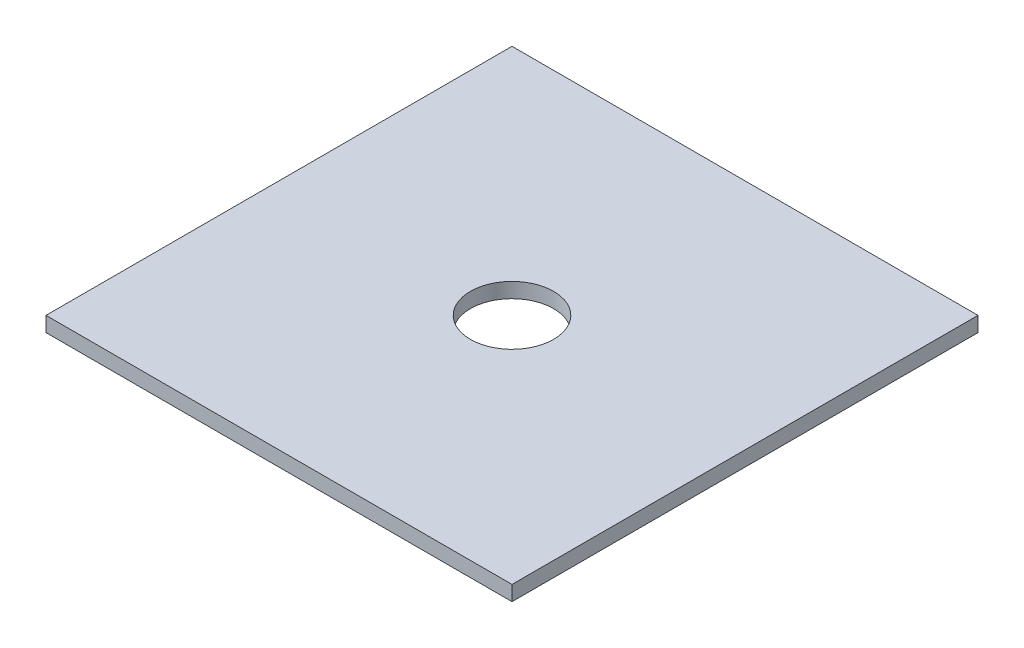
ISO-10303-21;
HEADER;
FILE_DESCRIPTION(('STEP AP214'),'2;1');
FILE_NAME('part.step','',(''),(''),'','','');
FILE_SCHEMA(('AUTOMOTIVE_DESIGN { 1 0 10303 214 1 1 1 1 }'));
ENDSEC;
DATA;
#1=APPLICATION_CONTEXT('core data for automotive mechanical design processes');
#2=APPLICATION_PROTOCOL_DEFINITION('international standard','automotive_design',2000,#1);
#3=PRODUCT_CONTEXT('',#1,'mechanical');
#4=PRODUCT('Part','Part','',(#3));
#5=PRODUCT_RELATED_PRODUCT_CATEGORY('part','',(#4));
#6=PRODUCT_DEFINITION_FORMATION('','',#4);
#7=PRODUCT_DEFINITION_CONTEXT('part definition',#1,'design');
#8=PRODUCT_DEFINITION('design','',#6,#7);
#9=PRODUCT_DEFINITION_SHAPE('','',#8);
#10=(LENGTH_UNIT() NAMED_UNIT(*) SI_UNIT(.MILLI.,.METRE.));
#11=(NAMED_UNIT(*) PLANE_ANGLE_UNIT() SI_UNIT($,.RADIAN.));
#12=(NAMED_UNIT(*) SI_UNIT($,.STERADIAN.) SOLID_ANGLE_UNIT());
#13=UNCERTAINTY_MEASURE_WITH_UNIT(LENGTH_MEASURE(1.E-05),#10,'distance_accuracy_value','');
#14=(GEOMETRIC_REPRESENTATION_CONTEXT(3) GLOBAL_UNCERTAINTY_ASSIGNED_CONTEXT((#13)) GLOBAL_UNIT_ASSIGNED_CONTEXT((#10,
#11,#12)) REPRESENTATION_CONTEXT('',''));
#15=CARTESIAN_POINT('',(0.,0.,0.));
#16=DIRECTION('',(0.,0.,1.));
#17=DIRECTION('',(1.,0.,0.));
#18=AXIS2_PLACEMENT_3D('',#15,#16,#17);
#19=CARTESIAN_POINT('',(280.,18.,280.));
#20=DIRECTION('',(-1.,0.,0.));
#21=DIRECTION('',(0.,0.,1.));
#22=AXIS2_PLACEMENT_3D('',#19,#20,#21);
#23=PLANE('',#22);
#24=DIRECTION('',(0.,0.,-1.));
#25=VECTOR('',#24,1.);
#26=CARTESIAN_POINT('',(280.,0.,280.));
#27=LINE('',#26,#25);
#28=CARTESIAN_POINT('',(280.,0.,280.));
#29=VERTEX_POINT('',#28);
#30=CARTESIAN_POINT('',(280.,0.,-280.));
#31=VERTEX_POINT('',#30);
#32=EDGE_CURVE('E108',#29,#31,#27,.T.);
#33=ORIENTED_EDGE('',*,*,#32,.T.);
#34=DIRECTION('',(0.,-1.,0.));
#35=VECTOR('',#34,1.);
#36=CARTESIAN_POINT('',(280.,18.,-280.));
#37=LINE('',#36,#35);
#38=CARTESIAN_POINT('',(280.,18.,-280.));
#39=VERTEX_POINT('',#38);
#40=EDGE_CURVE('E11',#39,#31,#37,.T.);
#41=ORIENTED_EDGE('',*,*,#40,.F.);
#42=DIRECTION('',(0.,0.,-1.));
#43=VECTOR('',#42,1.);
#44=CARTESIAN_POINT('',(280.,18.,280.));
#45=LINE('',#44,#43);
#46=CARTESIAN_POINT('',(280.,18.,280.));
#47=VERTEX_POINT('',#46);
#48=EDGE_CURVE('E92',#47,#39,#45,.T.);
#49=ORIENTED_EDGE('',*,*,#48,.F.);
#50=DIRECTION('',(0.,-1.,0.));
#51=VECTOR('',#50,1.);
#52=CARTESIAN_POINT('',(280.,18.,280.));
#53=LINE('',#52,#51);
#54=EDGE_CURVE('E104',#47,#29,#53,.T.);
#55=ORIENTED_EDGE('',*,*,#54,.T.);
#56=EDGE_LOOP('',(#33,#41,#49,#55));
#57=FACE_BOUND('',#56,.T.);
#58=ADVANCED_FACE('F40',(#57),#23,.F.);
#59=CARTESIAN_POINT('',(-280.,18.,-280.));
#60=DIRECTION('',(0.,0.,1.));
#61=DIRECTION('',(1.,0.,0.));
#62=AXIS2_PLACEMENT_3D('',#59,#60,#61);
#63=PLANE('',#62);
#64=DIRECTION('',(-1.,0.,0.));
#65=VECTOR('',#64,1.);
#66=CARTESIAN_POINT('',(-280.,0.,-280.));
#67=LINE('',#66,#65);
#68=CARTESIAN_POINT('',(-280.,0.,-280.));
#69=VERTEX_POINT('',#68);
#70=EDGE_CURVE('E97',#31,#69,#67,.T.);
#71=ORIENTED_EDGE('',*,*,#70,.T.);
#72=DIRECTION('',(0.,-1.,0.));
#73=VECTOR('',#72,1.);
#74=CARTESIAN_POINT('',(-280.,18.,-280.));
#75=LINE('',#74,#73);
#76=CARTESIAN_POINT('',(-280.,18.,-280.));
#77=VERTEX_POINT('',#76);
#78=EDGE_CURVE('E49',#77,#69,#75,.T.);
#79=ORIENTED_EDGE('',*,*,#78,.F.);
#80=DIRECTION('',(-1.,0.,0.));
#81=VECTOR('',#80,1.);
#82=CARTESIAN_POINT('',(-280.,18.,-280.));
#83=LINE('',#82,#81);
#84=EDGE_CURVE('E87',#39,#77,#83,.T.);
#85=ORIENTED_EDGE('',*,*,#84,.F.);
#86=ORIENTED_EDGE('',*,*,#40,.T.);
#87=EDGE_LOOP('',(#71,#79,#85,#86));
#88=FACE_BOUND('',#87,.T.);
#89=ADVANCED_FACE('F96',(#88),#63,.F.);
#90=CARTESIAN_POINT('',(-280.,18.,280.));
#91=DIRECTION('',(1.,0.,0.));
#92=DIRECTION('',(0.,0.,-1.));
#93=AXIS2_PLACEMENT_3D('',#90,#91,#92);
#94=PLANE('',#93);
#95=DIRECTION('',(0.,0.,1.));
#96=VECTOR('',#95,1.);
#97=CARTESIAN_POINT('',(-280.,0.,280.));
#98=LINE('',#97,#96);
#99=CARTESIAN_POINT('',(-280.,0.,280.));
#100=VERTEX_POINT('',#99);
#101=EDGE_CURVE('E74',#69,#100,#98,.T.);
#102=ORIENTED_EDGE('',*,*,#101,.T.);
#103=DIRECTION('',(0.,-1.,0.));
#104=VECTOR('',#103,1.);
#105=CARTESIAN_POINT('',(-280.,18.,280.));
#106=LINE('',#105,#104);
#107=CARTESIAN_POINT('',(-280.,18.,280.));
#108=VERTEX_POINT('',#107);
#109=EDGE_CURVE('E99',#108,#100,#106,.T.);
#110=ORIENTED_EDGE('',*,*,#109,.F.);
#111=DIRECTION('',(0.,0.,1.));
#112=VECTOR('',#111,1.);
#113=CARTESIAN_POINT('',(-280.,18.,280.));
#114=LINE('',#113,#112);
#115=EDGE_CURVE('E90',#77,#108,#114,.T.);
#116=ORIENTED_EDGE('',*,*,#115,.F.);
#117=ORIENTED_EDGE('',*,*,#78,.T.);
#118=EDGE_LOOP('',(#102,#110,#116,#117));
#119=FACE_BOUND('',#118,.T.);
#120=ADVANCED_FACE('F100',(#119),#94,.F.);
#121=CARTESIAN_POINT('',(-280.,18.,280.));
#122=DIRECTION('',(0.,0.,-1.));
#123=DIRECTION('',(-1.,0.,0.));
#124=AXIS2_PLACEMENT_3D('',#121,#122,#123);
#125=PLANE('',#124);
#126=DIRECTION('',(1.,0.,0.));
#127=VECTOR('',#126,1.);
#128=CARTESIAN_POINT('',(-280.,0.,280.));
#129=LINE('',#128,#127);
#130=EDGE_CURVE('E80',#100,#29,#129,.T.);
#131=ORIENTED_EDGE('',*,*,#130,.T.);
#132=ORIENTED_EDGE('',*,*,#54,.F.);
#133=DIRECTION('',(1.,0.,0.));
#134=VECTOR('',#133,1.);
#135=CARTESIAN_POINT('',(-280.,18.,280.));
#136=LINE('',#135,#134);
#137=EDGE_CURVE('E57',#108,#47,#136,.T.);
#138=ORIENTED_EDGE('',*,*,#137,.F.);
#139=ORIENTED_EDGE('',*,*,#109,.T.);
#140=EDGE_LOOP('',(#131,#132,#138,#139));
#141=FACE_BOUND('',#140,.T.);
#142=ADVANCED_FACE('F122',(#141),#125,.F.);
#143=CARTESIAN_POINT('',(0.,18.,0.));
#144=DIRECTION('',(0.,-1.,0.));
#145=DIRECTION('',(0.,0.,-1.));
#146=AXIS2_PLACEMENT_3D('',#143,#144,#145);
#147=PLANE('',#146);
#148=CARTESIAN_POINT('',(0.,18.,0.));
#149=DIRECTION('',(0.,1.,0.));
#150=DIRECTION('',(0.,0.,1.));
#151=AXIS2_PLACEMENT_3D('',#148,#149,#150);
#152=CIRCLE('',#151,50.);
#153=CARTESIAN_POINT('',(0.,18.,50.));
#154=VERTEX_POINT('',#153);
#155=EDGE_CURVE('E129',#154,#154,#152,.T.);
#156=ORIENTED_EDGE('',*,*,#155,.F.);
#157=EDGE_LOOP('',(#156));
#158=FACE_BOUND('',#157,.T.);
#159=ORIENTED_EDGE('',*,*,#48,.T.);
#160=ORIENTED_EDGE('',*,*,#84,.T.);
#161=ORIENTED_EDGE('',*,*,#115,.T.);
#162=ORIENTED_EDGE('',*,*,#137,.T.);
#163=EDGE_LOOP('',(#159,#160,#161,#162));
#164=FACE_BOUND('',#163,.T.);
#165=ADVANCED_FACE('F88',(#158,#164),#147,.F.);
#166=CARTESIAN_POINT('',(0.,0.,0.));
#167=DIRECTION('',(0.,-1.,0.));
#168=DIRECTION('',(0.,0.,-1.));
#169=AXIS2_PLACEMENT_3D('',#166,#167,#168);
#170=PLANE('',#169);
#171=CARTESIAN_POINT('',(0.,0.,0.));
#172=DIRECTION('',(0.,1.,0.));
#173=DIRECTION('',(0.,0.,1.));
#174=AXIS2_PLACEMENT_3D('',#171,#172,#173);
#175=CIRCLE('',#174,50.);
#176=CARTESIAN_POINT('',(0.,0.,50.));
#177=VERTEX_POINT('',#176);
#178=EDGE_CURVE('E112',#177,#177,#175,.T.);
#179=ORIENTED_EDGE('',*,*,#178,.T.);
#180=EDGE_LOOP('',(#179));
#181=FACE_BOUND('',#180,.T.);
#182=ORIENTED_EDGE('',*,*,#32,.F.);
#183=ORIENTED_EDGE('',*,*,#130,.F.);
#184=ORIENTED_EDGE('',*,*,#101,.F.);
#185=ORIENTED_EDGE('',*,*,#70,.F.);
#186=EDGE_LOOP('',(#182,#183,#184,#185));
#187=FACE_BOUND('',#186,.T.);
#188=ADVANCED_FACE('F125',(#181,#187),#170,.T.);
#189=CARTESIAN_POINT('',(0.,0.,0.));
#190=DIRECTION('',(0.,1.,0.));
#191=DIRECTION('',(0.,0.,1.));
#192=AXIS2_PLACEMENT_3D('',#189,#190,#191);
#193=CYLINDRICAL_SURFACE('',#192,50.);
#194=ORIENTED_EDGE('',*,*,#178,.F.);
#195=EDGE_LOOP('',(#194));
#196=FACE_BOUND('',#195,.T.);
#197=ORIENTED_EDGE('',*,*,#155,.T.);
#198=EDGE_LOOP('',(#197));
#199=FACE_BOUND('',#198,.T.);
#200=ADVANCED_FACE('F138',(#196,#199),#193,.F.);
#201=CLOSED_SHELL('',(#58,#89,#120,#142,#165,#188,#200));
#202=MANIFOLD_SOLID_BREP('B2',#201);
#203=ADVANCED_BREP_SHAPE_REPRESENTATION('',(#18,#202),#14);
#204=SHAPE_DEFINITION_REPRESENTATION(#9,#203);
ENDSEC;
END-ISO-10303-21;
